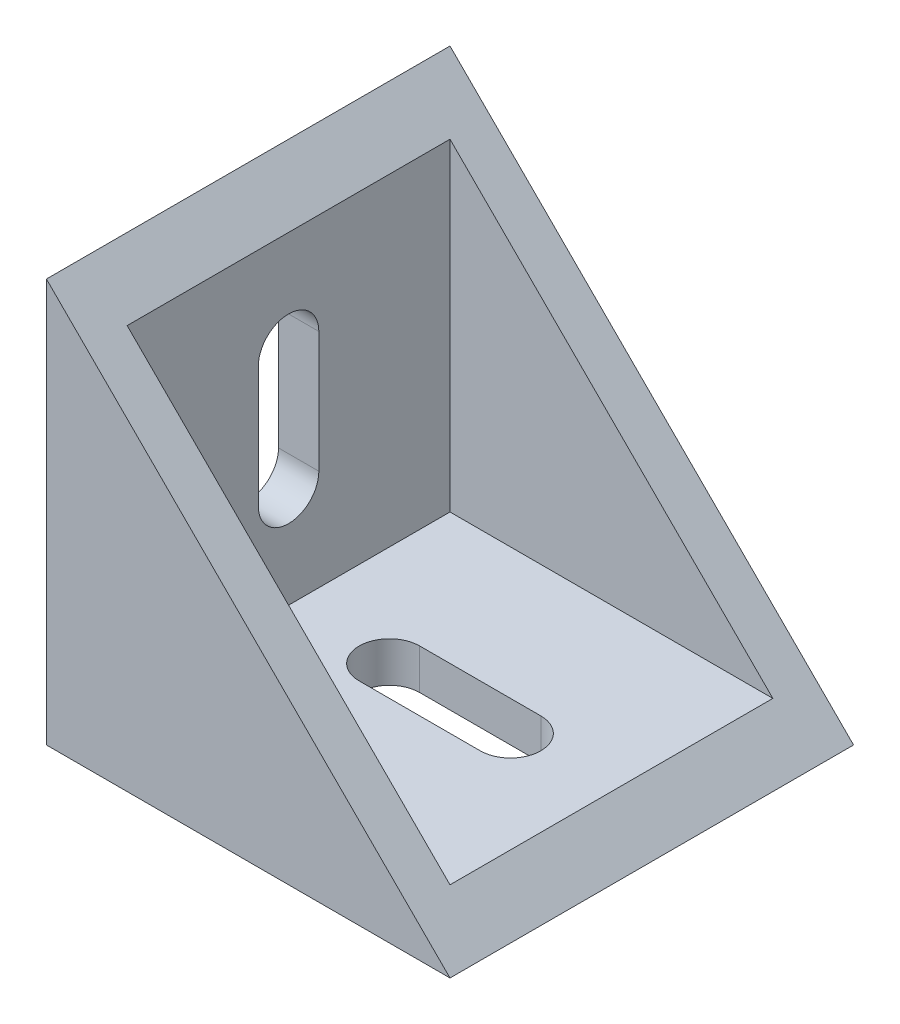
ISO-10303-21;
HEADER;
FILE_DESCRIPTION(('STEP AP214'),'2;1');
FILE_NAME('part.step','',(''),(''),'','','');
FILE_SCHEMA(('AUTOMOTIVE_DESIGN { 1 0 10303 214 1 1 1 1 }'));
ENDSEC;
DATA;
#1=APPLICATION_CONTEXT('core data for automotive mechanical design processes');
#2=APPLICATION_PROTOCOL_DEFINITION('international standard','automotive_design',2000,#1);
#3=PRODUCT_CONTEXT('',#1,'mechanical');
#4=PRODUCT('Part','Part','',(#3));
#5=PRODUCT_RELATED_PRODUCT_CATEGORY('part','',(#4));
#6=PRODUCT_DEFINITION_FORMATION('','',#4);
#7=PRODUCT_DEFINITION_CONTEXT('part definition',#1,'design');
#8=PRODUCT_DEFINITION('design','',#6,#7);
#9=PRODUCT_DEFINITION_SHAPE('','',#8);
#10=(LENGTH_UNIT() NAMED_UNIT(*) SI_UNIT(.MILLI.,.METRE.));
#11=(NAMED_UNIT(*) PLANE_ANGLE_UNIT() SI_UNIT($,.RADIAN.));
#12=(NAMED_UNIT(*) SI_UNIT($,.STERADIAN.) SOLID_ANGLE_UNIT());
#13=UNCERTAINTY_MEASURE_WITH_UNIT(LENGTH_MEASURE(1.E-05),#10,'distance_accuracy_value','');
#14=(GEOMETRIC_REPRESENTATION_CONTEXT(3) GLOBAL_UNCERTAINTY_ASSIGNED_CONTEXT((#13)) GLOBAL_UNIT_ASSIGNED_CONTEXT((#10,
#11,#12)) REPRESENTATION_CONTEXT('',''));
#15=CARTESIAN_POINT('',(0.,0.,0.));
#16=DIRECTION('',(0.,0.,1.));
#17=DIRECTION('',(1.,0.,0.));
#18=AXIS2_PLACEMENT_3D('',#15,#16,#17);
#19=CARTESIAN_POINT('',(-10.,10.,20.));
#20=DIRECTION('',(-0.707106781186547,-0.707106781186548,0.));
#21=DIRECTION('',(0.707106781186548,-0.707106781186547,0.));
#22=AXIS2_PLACEMENT_3D('',#19,#20,#21);
#23=PLANE('',#22);
#24=DIRECTION('',(-0.707106781186548,0.707106781186547,0.));
#25=VECTOR('',#24,1.);
#26=CARTESIAN_POINT('',(-10.,10.,0.));
#27=LINE('',#26,#25);
#28=CARTESIAN_POINT('',(10.,-9.99999999999999,0.));
#29=VERTEX_POINT('',#28);
#30=CARTESIAN_POINT('',(-10.,10.,0.));
#31=VERTEX_POINT('',#30);
#32=EDGE_CURVE('E234',#29,#31,#27,.T.);
#33=ORIENTED_EDGE('',*,*,#32,.T.);
#34=DIRECTION('',(0.,0.,-1.));
#35=VECTOR('',#34,1.);
#36=CARTESIAN_POINT('',(-10.,10.,20.));
#37=LINE('',#36,#35);
#38=CARTESIAN_POINT('',(-10.,10.,20.));
#39=VERTEX_POINT('',#38);
#40=EDGE_CURVE('E238',#39,#31,#37,.T.);
#41=ORIENTED_EDGE('',*,*,#40,.F.);
#42=DIRECTION('',(-0.707106781186548,0.707106781186547,0.));
#43=VECTOR('',#42,1.);
#44=CARTESIAN_POINT('',(-10.,10.,20.));
#45=LINE('',#44,#43);
#46=CARTESIAN_POINT('',(10.,-9.99999999999999,20.));
#47=VERTEX_POINT('',#46);
#48=EDGE_CURVE('E236',#47,#39,#45,.T.);
#49=ORIENTED_EDGE('',*,*,#48,.F.);
#50=DIRECTION('',(0.,0.,-1.));
#51=VECTOR('',#50,1.);
#52=CARTESIAN_POINT('',(10.,-9.99999999999999,20.));
#53=LINE('',#52,#51);
#54=EDGE_CURVE('E42',#47,#29,#53,.T.);
#55=ORIENTED_EDGE('',*,*,#54,.T.);
#56=EDGE_LOOP('',(#33,#41,#49,#55));
#57=FACE_BOUND('',#56,.T.);
#58=DIRECTION('',(-0.707106781186548,0.707106781186547,0.));
#59=VECTOR('',#58,1.);
#60=CARTESIAN_POINT('',(0.,0.,2.));
#61=LINE('',#60,#59);
#62=CARTESIAN_POINT('',(8.,-7.99999999999999,2.));
#63=VERTEX_POINT('',#62);
#64=CARTESIAN_POINT('',(-8.,8.,2.));
#65=VERTEX_POINT('',#64);
#66=EDGE_CURVE('E217',#63,#65,#61,.T.);
#67=ORIENTED_EDGE('',*,*,#66,.F.);
#68=DIRECTION('',(0.,0.,-1.));
#69=VECTOR('',#68,1.);
#70=CARTESIAN_POINT('',(8.,-8.,20.));
#71=LINE('',#70,#69);
#72=CARTESIAN_POINT('',(8.,-7.99999999999999,18.));
#73=VERTEX_POINT('',#72);
#74=EDGE_CURVE('E212',#73,#63,#71,.T.);
#75=ORIENTED_EDGE('',*,*,#74,.F.);
#76=DIRECTION('',(-0.707106781186548,0.707106781186547,0.));
#77=VECTOR('',#76,1.);
#78=CARTESIAN_POINT('',(0.,0.,18.));
#79=LINE('',#78,#77);
#80=CARTESIAN_POINT('',(-8.,8.,18.));
#81=VERTEX_POINT('',#80);
#82=EDGE_CURVE('E221',#73,#81,#79,.T.);
#83=ORIENTED_EDGE('',*,*,#82,.T.);
#84=DIRECTION('',(0.,0.,-1.));
#85=VECTOR('',#84,1.);
#86=CARTESIAN_POINT('',(-8.,8.,20.));
#87=LINE('',#86,#85);
#88=EDGE_CURVE('E222',#81,#65,#87,.T.);
#89=ORIENTED_EDGE('',*,*,#88,.T.);
#90=EDGE_LOOP('',(#67,#75,#83,#89));
#91=FACE_BOUND('',#90,.T.);
#92=ADVANCED_FACE('F34',(#57,#91),#23,.F.);
#93=CARTESIAN_POINT('',(-10.,-10.,20.));
#94=DIRECTION('',(1.,0.,0.));
#95=DIRECTION('',(0.,0.,-1.));
#96=AXIS2_PLACEMENT_3D('',#93,#94,#95);
#97=PLANE('',#96);
#98=DIRECTION('',(0.,1.,0.));
#99=VECTOR('',#98,1.);
#100=CARTESIAN_POINT('',(-10.,-9.99999999999999,8.49999999999999));
#101=LINE('',#100,#99);
#102=CARTESIAN_POINT('',(-10.,-3.,8.5));
#103=VERTEX_POINT('',#102);
#104=CARTESIAN_POINT('',(-10.,3.,8.5));
#105=VERTEX_POINT('',#104);
#106=EDGE_CURVE('E198',#103,#105,#101,.T.);
#107=ORIENTED_EDGE('',*,*,#106,.T.);
#108=CARTESIAN_POINT('',(-10.,3.,10.));
#109=DIRECTION('',(1.,0.,0.));
#110=DIRECTION('',(0.,0.,-1.));
#111=AXIS2_PLACEMENT_3D('',#108,#109,#110);
#112=CIRCLE('',#111,1.5);
#113=CARTESIAN_POINT('',(-10.,3.,11.5));
#114=VERTEX_POINT('',#113);
#115=EDGE_CURVE('E201',#105,#114,#112,.T.);
#116=ORIENTED_EDGE('',*,*,#115,.T.);
#117=DIRECTION('',(0.,-1.,0.));
#118=VECTOR('',#117,1.);
#119=CARTESIAN_POINT('',(-10.,-10.,11.5));
#120=LINE('',#119,#118);
#121=CARTESIAN_POINT('',(-10.,-3.,11.5));
#122=VERTEX_POINT('',#121);
#123=EDGE_CURVE('E186',#114,#122,#120,.T.);
#124=ORIENTED_EDGE('',*,*,#123,.T.);
#125=CARTESIAN_POINT('',(-10.,-3.,10.));
#126=DIRECTION('',(1.,0.,0.));
#127=DIRECTION('',(0.,0.,-1.));
#128=AXIS2_PLACEMENT_3D('',#125,#126,#127);
#129=CIRCLE('',#128,1.5);
#130=EDGE_CURVE('E195',#122,#103,#129,.T.);
#131=ORIENTED_EDGE('',*,*,#130,.T.);
#132=EDGE_LOOP('',(#107,#116,#124,#131));
#133=FACE_BOUND('',#132,.T.);
#134=DIRECTION('',(0.,-1.,0.));
#135=VECTOR('',#134,1.);
#136=CARTESIAN_POINT('',(-10.,-10.,0.));
#137=LINE('',#136,#135);
#138=CARTESIAN_POINT('',(-10.,-10.,0.));
#139=VERTEX_POINT('',#138);
#140=EDGE_CURVE('E211',#31,#139,#137,.T.);
#141=ORIENTED_EDGE('',*,*,#140,.T.);
#142=DIRECTION('',(0.,0.,-1.));
#143=VECTOR('',#142,1.);
#144=CARTESIAN_POINT('',(-10.,-10.,20.));
#145=LINE('',#144,#143);
#146=CARTESIAN_POINT('',(-10.,-10.,20.));
#147=VERTEX_POINT('',#146);
#148=EDGE_CURVE('E11',#147,#139,#145,.T.);
#149=ORIENTED_EDGE('',*,*,#148,.F.);
#150=DIRECTION('',(0.,-1.,0.));
#151=VECTOR('',#150,1.);
#152=CARTESIAN_POINT('',(-10.,-10.,20.));
#153=LINE('',#152,#151);
#154=EDGE_CURVE('E230',#39,#147,#153,.T.);
#155=ORIENTED_EDGE('',*,*,#154,.F.);
#156=ORIENTED_EDGE('',*,*,#40,.T.);
#157=EDGE_LOOP('',(#141,#149,#155,#156));
#158=FACE_BOUND('',#157,.T.);
#159=ADVANCED_FACE('F36',(#133,#158),#97,.F.);
#160=CARTESIAN_POINT('',(-10.,-10.,20.));
#161=DIRECTION('',(0.,1.,0.));
#162=DIRECTION('',(-1.,0.,0.));
#163=AXIS2_PLACEMENT_3D('',#160,#161,#162);
#164=PLANE('',#163);
#165=DIRECTION('',(-1.,0.,0.));
#166=VECTOR('',#165,1.);
#167=CARTESIAN_POINT('',(-10.,-10.,8.50000000000001));
#168=LINE('',#167,#166);
#169=CARTESIAN_POINT('',(3.,-9.99999999999999,8.5));
#170=VERTEX_POINT('',#169);
#171=CARTESIAN_POINT('',(-3.,-9.99999999999999,8.50000000000001));
#172=VERTEX_POINT('',#171);
#173=EDGE_CURVE('E166',#170,#172,#168,.T.);
#174=ORIENTED_EDGE('',*,*,#173,.T.);
#175=CARTESIAN_POINT('',(-3.,-10.,10.));
#176=DIRECTION('',(0.,1.,0.));
#177=DIRECTION('',(-1.,0.,0.));
#178=AXIS2_PLACEMENT_3D('',#175,#176,#177);
#179=CIRCLE('',#178,1.5);
#180=CARTESIAN_POINT('',(-3.,-9.99999999999999,11.5));
#181=VERTEX_POINT('',#180);
#182=EDGE_CURVE('E169',#172,#181,#179,.T.);
#183=ORIENTED_EDGE('',*,*,#182,.T.);
#184=DIRECTION('',(1.,0.,0.));
#185=VECTOR('',#184,1.);
#186=CARTESIAN_POINT('',(-10.,-10.,11.5));
#187=LINE('',#186,#185);
#188=CARTESIAN_POINT('',(3.,-10.,11.5));
#189=VERTEX_POINT('',#188);
#190=EDGE_CURVE('E161',#181,#189,#187,.T.);
#191=ORIENTED_EDGE('',*,*,#190,.T.);
#192=CARTESIAN_POINT('',(3.,-9.99999999999999,10.));
#193=DIRECTION('',(0.,1.,0.));
#194=DIRECTION('',(-1.,0.,0.));
#195=AXIS2_PLACEMENT_3D('',#192,#193,#194);
#196=CIRCLE('',#195,1.5);
#197=EDGE_CURVE('E141',#189,#170,#196,.T.);
#198=ORIENTED_EDGE('',*,*,#197,.T.);
#199=EDGE_LOOP('',(#174,#183,#191,#198));
#200=FACE_BOUND('',#199,.T.);
#201=DIRECTION('',(1.,0.,0.));
#202=VECTOR('',#201,1.);
#203=CARTESIAN_POINT('',(-10.,-10.,0.));
#204=LINE('',#203,#202);
#205=EDGE_CURVE('E241',#139,#29,#204,.T.);
#206=ORIENTED_EDGE('',*,*,#205,.T.);
#207=ORIENTED_EDGE('',*,*,#54,.F.);
#208=DIRECTION('',(1.,0.,0.));
#209=VECTOR('',#208,1.);
#210=CARTESIAN_POINT('',(-10.,-10.,20.));
#211=LINE('',#210,#209);
#212=EDGE_CURVE('E233',#147,#47,#211,.T.);
#213=ORIENTED_EDGE('',*,*,#212,.F.);
#214=ORIENTED_EDGE('',*,*,#148,.T.);
#215=EDGE_LOOP('',(#206,#207,#213,#214));
#216=FACE_BOUND('',#215,.T.);
#217=ADVANCED_FACE('F261',(#200,#216),#164,.F.);
#218=CARTESIAN_POINT('',(0.,0.,20.));
#219=DIRECTION('',(0.,0.,-1.));
#220=DIRECTION('',(-1.,0.,0.));
#221=AXIS2_PLACEMENT_3D('',#218,#219,#220);
#222=PLANE('',#221);
#223=ORIENTED_EDGE('',*,*,#154,.T.);
#224=ORIENTED_EDGE('',*,*,#212,.T.);
#225=ORIENTED_EDGE('',*,*,#48,.T.);
#226=EDGE_LOOP('',(#223,#224,#225));
#227=FACE_BOUND('',#226,.T.);
#228=ADVANCED_FACE('F260',(#227),#222,.F.);
#229=CARTESIAN_POINT('',(0.,0.,0.));
#230=DIRECTION('',(0.,0.,-1.));
#231=DIRECTION('',(-1.,0.,0.));
#232=AXIS2_PLACEMENT_3D('',#229,#230,#231);
#233=PLANE('',#232);
#234=ORIENTED_EDGE('',*,*,#140,.F.);
#235=ORIENTED_EDGE('',*,*,#32,.F.);
#236=ORIENTED_EDGE('',*,*,#205,.F.);
#237=EDGE_LOOP('',(#234,#235,#236));
#238=FACE_BOUND('',#237,.T.);
#239=ADVANCED_FACE('F255',(#238),#233,.T.);
#240=CARTESIAN_POINT('',(-8.,-10.,20.));
#241=DIRECTION('',(1.,0.,0.));
#242=DIRECTION('',(0.,0.,-1.));
#243=AXIS2_PLACEMENT_3D('',#240,#241,#242);
#244=PLANE('',#243);
#245=CARTESIAN_POINT('',(-8.,3.,10.));
#246=DIRECTION('',(1.,0.,0.));
#247=DIRECTION('',(0.,0.,-1.));
#248=AXIS2_PLACEMENT_3D('',#245,#246,#247);
#249=CIRCLE('',#248,1.5);
#250=CARTESIAN_POINT('',(-8.,3.,8.5));
#251=VERTEX_POINT('',#250);
#252=CARTESIAN_POINT('',(-8.,3.,11.5));
#253=VERTEX_POINT('',#252);
#254=EDGE_CURVE('E172',#251,#253,#249,.T.);
#255=ORIENTED_EDGE('',*,*,#254,.F.);
#256=DIRECTION('',(0.,1.,0.));
#257=VECTOR('',#256,1.);
#258=CARTESIAN_POINT('',(-8.,3.,8.5));
#259=LINE('',#258,#257);
#260=CARTESIAN_POINT('',(-8.,-3.,8.5));
#261=VERTEX_POINT('',#260);
#262=EDGE_CURVE('E180',#261,#251,#259,.T.);
#263=ORIENTED_EDGE('',*,*,#262,.F.);
#264=CARTESIAN_POINT('',(-8.,-3.,10.));
#265=DIRECTION('',(1.,0.,0.));
#266=DIRECTION('',(0.,0.,-1.));
#267=AXIS2_PLACEMENT_3D('',#264,#265,#266);
#268=CIRCLE('',#267,1.5);
#269=CARTESIAN_POINT('',(-8.,-3.,11.5));
#270=VERTEX_POINT('',#269);
#271=EDGE_CURVE('E177',#270,#261,#268,.T.);
#272=ORIENTED_EDGE('',*,*,#271,.F.);
#273=DIRECTION('',(0.,-1.,0.));
#274=VECTOR('',#273,1.);
#275=CARTESIAN_POINT('',(-8.,3.,11.5));
#276=LINE('',#275,#274);
#277=EDGE_CURVE('E174',#253,#270,#276,.T.);
#278=ORIENTED_EDGE('',*,*,#277,.F.);
#279=EDGE_LOOP('',(#255,#263,#272,#278));
#280=FACE_BOUND('',#279,.T.);
#281=DIRECTION('',(0.,-1.,0.));
#282=VECTOR('',#281,1.);
#283=CARTESIAN_POINT('',(-8.,0.,2.));
#284=LINE('',#283,#282);
#285=CARTESIAN_POINT('',(-8.,-8.,2.));
#286=VERTEX_POINT('',#285);
#287=EDGE_CURVE('E204',#65,#286,#284,.T.);
#288=ORIENTED_EDGE('',*,*,#287,.F.);
#289=ORIENTED_EDGE('',*,*,#88,.F.);
#290=DIRECTION('',(0.,-1.,0.));
#291=VECTOR('',#290,1.);
#292=CARTESIAN_POINT('',(-8.,0.,18.));
#293=LINE('',#292,#291);
#294=CARTESIAN_POINT('',(-8.,-8.,18.));
#295=VERTEX_POINT('',#294);
#296=EDGE_CURVE('E213',#81,#295,#293,.T.);
#297=ORIENTED_EDGE('',*,*,#296,.T.);
#298=DIRECTION('',(0.,0.,-1.));
#299=VECTOR('',#298,1.);
#300=CARTESIAN_POINT('',(-8.,-8.,20.));
#301=LINE('',#300,#299);
#302=EDGE_CURVE('E208',#295,#286,#301,.T.);
#303=ORIENTED_EDGE('',*,*,#302,.T.);
#304=EDGE_LOOP('',(#288,#289,#297,#303));
#305=FACE_BOUND('',#304,.T.);
#306=ADVANCED_FACE('F276',(#280,#305),#244,.T.);
#307=CARTESIAN_POINT('',(-10.,-8.,20.));
#308=DIRECTION('',(0.,1.,0.));
#309=DIRECTION('',(-1.,0.,0.));
#310=AXIS2_PLACEMENT_3D('',#307,#308,#309);
#311=PLANE('',#310);
#312=CARTESIAN_POINT('',(-3.,-8.,10.));
#313=DIRECTION('',(0.,1.,0.));
#314=DIRECTION('',(-1.,0.,0.));
#315=AXIS2_PLACEMENT_3D('',#312,#313,#314);
#316=CIRCLE('',#315,1.5);
#317=CARTESIAN_POINT('',(-3.,-8.,8.50000000000001));
#318=VERTEX_POINT('',#317);
#319=CARTESIAN_POINT('',(-3.00000000000001,-8.,11.5));
#320=VERTEX_POINT('',#319);
#321=EDGE_CURVE('E57',#318,#320,#316,.T.);
#322=ORIENTED_EDGE('',*,*,#321,.F.);
#323=DIRECTION('',(-1.,0.,0.));
#324=VECTOR('',#323,1.);
#325=CARTESIAN_POINT('',(-3.,-8.,8.50000000000001));
#326=LINE('',#325,#324);
#327=CARTESIAN_POINT('',(3.,-8.,8.5));
#328=VERTEX_POINT('',#327);
#329=EDGE_CURVE('E154',#328,#318,#326,.T.);
#330=ORIENTED_EDGE('',*,*,#329,.F.);
#331=CARTESIAN_POINT('',(3.,-8.,10.));
#332=DIRECTION('',(0.,1.,0.));
#333=DIRECTION('',(-1.,0.,0.));
#334=AXIS2_PLACEMENT_3D('',#331,#332,#333);
#335=CIRCLE('',#334,1.5);
#336=CARTESIAN_POINT('',(3.,-8.,11.5));
#337=VERTEX_POINT('',#336);
#338=EDGE_CURVE('E138',#337,#328,#335,.T.);
#339=ORIENTED_EDGE('',*,*,#338,.F.);
#340=DIRECTION('',(1.,0.,0.));
#341=VECTOR('',#340,1.);
#342=CARTESIAN_POINT('',(-3.,-8.,11.5));
#343=LINE('',#342,#341);
#344=EDGE_CURVE('E147',#320,#337,#343,.T.);
#345=ORIENTED_EDGE('',*,*,#344,.F.);
#346=EDGE_LOOP('',(#322,#330,#339,#345));
#347=FACE_BOUND('',#346,.T.);
#348=DIRECTION('',(1.,0.,0.));
#349=VECTOR('',#348,1.);
#350=CARTESIAN_POINT('',(0.,-8.,2.));
#351=LINE('',#350,#349);
#352=EDGE_CURVE('E207',#286,#63,#351,.T.);
#353=ORIENTED_EDGE('',*,*,#352,.F.);
#354=ORIENTED_EDGE('',*,*,#302,.F.);
#355=DIRECTION('',(1.,0.,0.));
#356=VECTOR('',#355,1.);
#357=CARTESIAN_POINT('',(0.,-8.,18.));
#358=LINE('',#357,#356);
#359=EDGE_CURVE('E216',#295,#73,#358,.T.);
#360=ORIENTED_EDGE('',*,*,#359,.T.);
#361=ORIENTED_EDGE('',*,*,#74,.T.);
#362=EDGE_LOOP('',(#353,#354,#360,#361));
#363=FACE_BOUND('',#362,.T.);
#364=ADVANCED_FACE('F151',(#347,#363),#311,.T.);
#365=CARTESIAN_POINT('',(0.,0.,18.));
#366=DIRECTION('',(0.,0.,-1.));
#367=DIRECTION('',(-1.,0.,0.));
#368=AXIS2_PLACEMENT_3D('',#365,#366,#367);
#369=PLANE('',#368);
#370=ORIENTED_EDGE('',*,*,#296,.F.);
#371=ORIENTED_EDGE('',*,*,#82,.F.);
#372=ORIENTED_EDGE('',*,*,#359,.F.);
#373=EDGE_LOOP('',(#370,#371,#372));
#374=FACE_BOUND('',#373,.T.);
#375=ADVANCED_FACE('F282',(#374),#369,.T.);
#376=CARTESIAN_POINT('',(0.,0.,2.));
#377=DIRECTION('',(0.,0.,-1.));
#378=DIRECTION('',(-1.,0.,0.));
#379=AXIS2_PLACEMENT_3D('',#376,#377,#378);
#380=PLANE('',#379);
#381=ORIENTED_EDGE('',*,*,#287,.T.);
#382=ORIENTED_EDGE('',*,*,#352,.T.);
#383=ORIENTED_EDGE('',*,*,#66,.T.);
#384=EDGE_LOOP('',(#381,#382,#383));
#385=FACE_BOUND('',#384,.T.);
#386=ADVANCED_FACE('F278',(#385),#380,.F.);
#387=CARTESIAN_POINT('',(-28.,3.,10.));
#388=DIRECTION('',(1.,0.,0.));
#389=DIRECTION('',(0.,0.,-1.));
#390=AXIS2_PLACEMENT_3D('',#387,#388,#389);
#391=CYLINDRICAL_SURFACE('',#390,1.5);
#392=DIRECTION('',(1.,0.,0.));
#393=VECTOR('',#392,1.);
#394=CARTESIAN_POINT('',(-28.,3.,8.5));
#395=LINE('',#394,#393);
#396=EDGE_CURVE('E184',#105,#251,#395,.T.);
#397=ORIENTED_EDGE('',*,*,#396,.T.);
#398=ORIENTED_EDGE('',*,*,#254,.T.);
#399=DIRECTION('',(1.,0.,0.));
#400=VECTOR('',#399,1.);
#401=CARTESIAN_POINT('',(-28.,3.,11.5));
#402=LINE('',#401,#400);
#403=EDGE_CURVE('E183',#114,#253,#402,.T.);
#404=ORIENTED_EDGE('',*,*,#403,.F.);
#405=ORIENTED_EDGE('',*,*,#115,.F.);
#406=EDGE_LOOP('',(#397,#398,#404,#405));
#407=FACE_BOUND('',#406,.T.);
#408=ADVANCED_FACE('F281',(#407),#391,.F.);
#409=CARTESIAN_POINT('',(-28.,3.,8.5));
#410=DIRECTION('',(0.,0.,-1.));
#411=DIRECTION('',(0.,1.,0.));
#412=AXIS2_PLACEMENT_3D('',#409,#410,#411);
#413=PLANE('',#412);
#414=DIRECTION('',(1.,0.,0.));
#415=VECTOR('',#414,1.);
#416=CARTESIAN_POINT('',(-28.,-3.,8.5));
#417=LINE('',#416,#415);
#418=EDGE_CURVE('E187',#103,#261,#417,.T.);
#419=ORIENTED_EDGE('',*,*,#418,.T.);
#420=ORIENTED_EDGE('',*,*,#262,.T.);
#421=ORIENTED_EDGE('',*,*,#396,.F.);
#422=ORIENTED_EDGE('',*,*,#106,.F.);
#423=EDGE_LOOP('',(#419,#420,#421,#422));
#424=FACE_BOUND('',#423,.T.);
#425=ADVANCED_FACE('F294',(#424),#413,.F.);
#426=CARTESIAN_POINT('',(-28.,-3.,10.));
#427=DIRECTION('',(1.,0.,0.));
#428=DIRECTION('',(0.,0.,-1.));
#429=AXIS2_PLACEMENT_3D('',#426,#427,#428);
#430=CYLINDRICAL_SURFACE('',#429,1.5);
#431=DIRECTION('',(1.,0.,0.));
#432=VECTOR('',#431,1.);
#433=CARTESIAN_POINT('',(-28.,-3.,11.5));
#434=LINE('',#433,#432);
#435=EDGE_CURVE('E189',#122,#270,#434,.T.);
#436=ORIENTED_EDGE('',*,*,#435,.T.);
#437=ORIENTED_EDGE('',*,*,#271,.T.);
#438=ORIENTED_EDGE('',*,*,#418,.F.);
#439=ORIENTED_EDGE('',*,*,#130,.F.);
#440=EDGE_LOOP('',(#436,#437,#438,#439));
#441=FACE_BOUND('',#440,.T.);
#442=ADVANCED_FACE('F300',(#441),#430,.F.);
#443=CARTESIAN_POINT('',(-28.,3.,11.5));
#444=DIRECTION('',(0.,0.,1.));
#445=DIRECTION('',(0.,-1.,0.));
#446=AXIS2_PLACEMENT_3D('',#443,#444,#445);
#447=PLANE('',#446);
#448=ORIENTED_EDGE('',*,*,#403,.T.);
#449=ORIENTED_EDGE('',*,*,#277,.T.);
#450=ORIENTED_EDGE('',*,*,#435,.F.);
#451=ORIENTED_EDGE('',*,*,#123,.F.);
#452=EDGE_LOOP('',(#448,#449,#450,#451));
#453=FACE_BOUND('',#452,.T.);
#454=ADVANCED_FACE('F296',(#453),#447,.F.);
#455=CARTESIAN_POINT('',(-3.,-28.,10.));
#456=DIRECTION('',(0.,1.,0.));
#457=DIRECTION('',(-1.,0.,0.));
#458=AXIS2_PLACEMENT_3D('',#455,#456,#457);
#459=CYLINDRICAL_SURFACE('',#458,1.5);
#460=DIRECTION('',(0.,1.,0.));
#461=VECTOR('',#460,1.);
#462=CARTESIAN_POINT('',(-3.,-28.,8.50000000000001));
#463=LINE('',#462,#461);
#464=EDGE_CURVE('E159',#172,#318,#463,.T.);
#465=ORIENTED_EDGE('',*,*,#464,.T.);
#466=ORIENTED_EDGE('',*,*,#321,.T.);
#467=DIRECTION('',(0.,1.,0.));
#468=VECTOR('',#467,1.);
#469=CARTESIAN_POINT('',(-3.,-28.,11.5));
#470=LINE('',#469,#468);
#471=EDGE_CURVE('E144',#181,#320,#470,.T.);
#472=ORIENTED_EDGE('',*,*,#471,.F.);
#473=ORIENTED_EDGE('',*,*,#182,.F.);
#474=EDGE_LOOP('',(#465,#466,#472,#473));
#475=FACE_BOUND('',#474,.T.);
#476=ADVANCED_FACE('F299',(#475),#459,.F.);
#477=CARTESIAN_POINT('',(-3.,-28.,8.50000000000001));
#478=DIRECTION('',(0.,0.,-1.));
#479=DIRECTION('',(-1.,0.,0.));
#480=AXIS2_PLACEMENT_3D('',#477,#478,#479);
#481=PLANE('',#480);
#482=DIRECTION('',(0.,1.,0.));
#483=VECTOR('',#482,1.);
#484=CARTESIAN_POINT('',(3.,-28.,8.5));
#485=LINE('',#484,#483);
#486=EDGE_CURVE('E143',#170,#328,#485,.T.);
#487=ORIENTED_EDGE('',*,*,#486,.T.);
#488=ORIENTED_EDGE('',*,*,#329,.T.);
#489=ORIENTED_EDGE('',*,*,#464,.F.);
#490=ORIENTED_EDGE('',*,*,#173,.F.);
#491=EDGE_LOOP('',(#487,#488,#489,#490));
#492=FACE_BOUND('',#491,.T.);
#493=ADVANCED_FACE('F310',(#492),#481,.F.);
#494=CARTESIAN_POINT('',(3.,-28.,10.));
#495=DIRECTION('',(0.,1.,0.));
#496=DIRECTION('',(-1.,0.,0.));
#497=AXIS2_PLACEMENT_3D('',#494,#495,#496);
#498=CYLINDRICAL_SURFACE('',#497,1.5);
#499=DIRECTION('',(0.,1.,0.));
#500=VECTOR('',#499,1.);
#501=CARTESIAN_POINT('',(3.,-28.,11.5));
#502=LINE('',#501,#500);
#503=EDGE_CURVE('E49',#189,#337,#502,.T.);
#504=ORIENTED_EDGE('',*,*,#503,.T.);
#505=ORIENTED_EDGE('',*,*,#338,.T.);
#506=ORIENTED_EDGE('',*,*,#486,.F.);
#507=ORIENTED_EDGE('',*,*,#197,.F.);
#508=EDGE_LOOP('',(#504,#505,#506,#507));
#509=FACE_BOUND('',#508,.T.);
#510=ADVANCED_FACE('F135',(#509),#498,.F.);
#511=CARTESIAN_POINT('',(-3.,-28.,11.5));
#512=DIRECTION('',(0.,0.,1.));
#513=DIRECTION('',(1.,0.,0.));
#514=AXIS2_PLACEMENT_3D('',#511,#512,#513);
#515=PLANE('',#514);
#516=ORIENTED_EDGE('',*,*,#471,.T.);
#517=ORIENTED_EDGE('',*,*,#344,.T.);
#518=ORIENTED_EDGE('',*,*,#503,.F.);
#519=ORIENTED_EDGE('',*,*,#190,.F.);
#520=EDGE_LOOP('',(#516,#517,#518,#519));
#521=FACE_BOUND('',#520,.T.);
#522=ADVANCED_FACE('F148',(#521),#515,.F.);
#523=CLOSED_SHELL('',(#92,#159,#217,#228,#239,#306,#364,#375,#386,#408,#425,#442,#454,#476,#493,
#510,#522));
#524=MANIFOLD_SOLID_BREP('B2',#523);
#525=ADVANCED_BREP_SHAPE_REPRESENTATION('',(#18,#524),#14);
#526=SHAPE_DEFINITION_REPRESENTATION(#9,#525);
ENDSEC;
END-ISO-10303-21;
